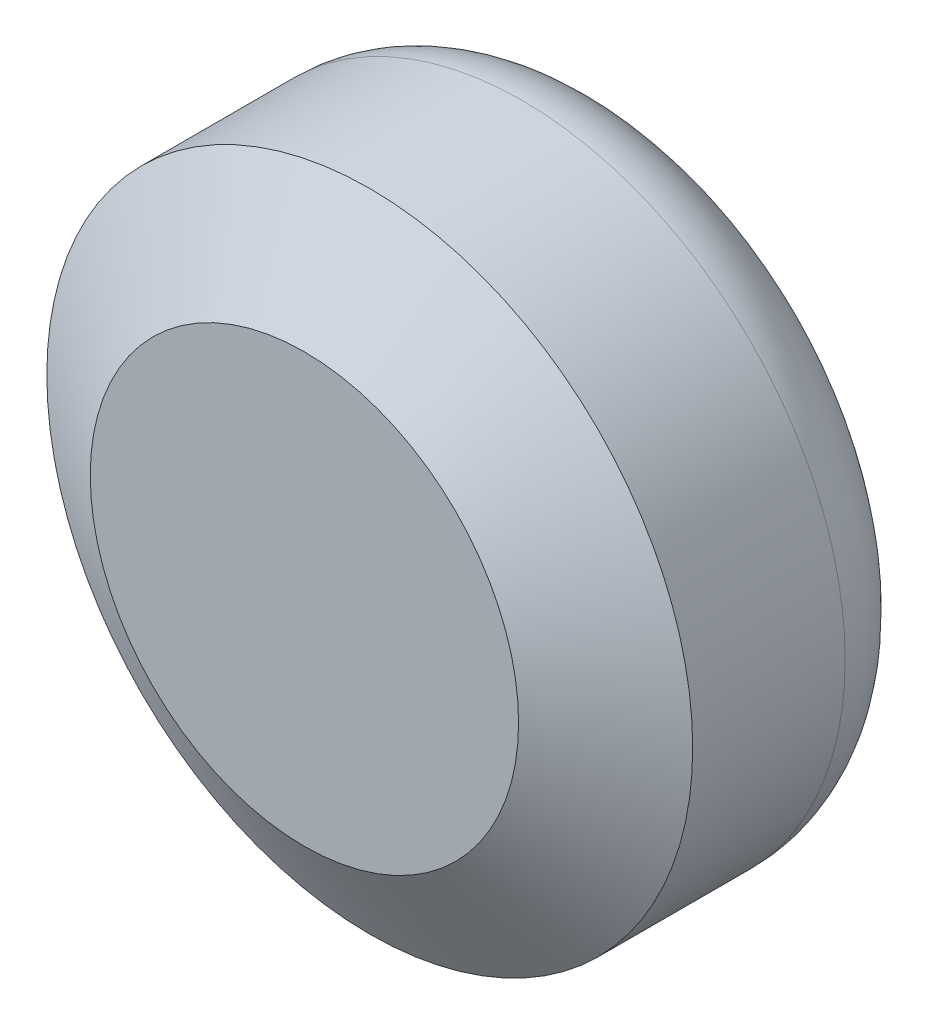
ISO-10303-21;
HEADER;
FILE_DESCRIPTION(('STEP AP214'),'2;1');
FILE_NAME('part.step','',(''),(''),'','','');
FILE_SCHEMA(('AUTOMOTIVE_DESIGN { 1 0 10303 214 1 1 1 1 }'));
ENDSEC;
DATA;
#1=APPLICATION_CONTEXT('core data for automotive mechanical design processes');
#2=APPLICATION_PROTOCOL_DEFINITION('international standard','automotive_design',2000,#1);
#3=PRODUCT_CONTEXT('',#1,'mechanical');
#4=PRODUCT('Part','Part','',(#3));
#5=PRODUCT_RELATED_PRODUCT_CATEGORY('part','',(#4));
#6=PRODUCT_DEFINITION_FORMATION('','',#4);
#7=PRODUCT_DEFINITION_CONTEXT('part definition',#1,'design');
#8=PRODUCT_DEFINITION('design','',#6,#7);
#9=PRODUCT_DEFINITION_SHAPE('','',#8);
#10=(LENGTH_UNIT() NAMED_UNIT(*) SI_UNIT(.MILLI.,.METRE.));
#11=(NAMED_UNIT(*) PLANE_ANGLE_UNIT() SI_UNIT($,.RADIAN.));
#12=(NAMED_UNIT(*) SI_UNIT($,.STERADIAN.) SOLID_ANGLE_UNIT());
#13=UNCERTAINTY_MEASURE_WITH_UNIT(LENGTH_MEASURE(1.E-05),#10,'distance_accuracy_value','');
#14=(GEOMETRIC_REPRESENTATION_CONTEXT(3) GLOBAL_UNCERTAINTY_ASSIGNED_CONTEXT((#13)) GLOBAL_UNIT_ASSIGNED_CONTEXT((#10,
#11,#12)) REPRESENTATION_CONTEXT('',''));
#15=CARTESIAN_POINT('',(0.,0.,0.));
#16=DIRECTION('',(0.,0.,1.));
#17=DIRECTION('',(1.,0.,0.));
#18=AXIS2_PLACEMENT_3D('',#15,#16,#17);
#19=CARTESIAN_POINT('',(-35.5777305835289,22.6224810051335,28.));
#20=DIRECTION('',(0.,0.,-1.));
#21=DIRECTION('',(-1.,0.,0.));
#22=AXIS2_PLACEMENT_3D('',#19,#20,#21);
#23=CYLINDRICAL_SURFACE('',#22,29.65);
#24=CARTESIAN_POINT('',(-35.5777305835289,22.6224810051335,8.));
#25=DIRECTION('',(0.,0.,1.));
#26=DIRECTION('',(1.,0.,0.));
#27=AXIS2_PLACEMENT_3D('',#24,#25,#26);
#28=CIRCLE('',#27,29.65);
#29=CARTESIAN_POINT('',(-5.92773058352891,22.6224810051335,8.));
#30=VERTEX_POINT('',#29);
#31=EDGE_CURVE('E38',#30,#30,#28,.T.);
#32=ORIENTED_EDGE('',*,*,#31,.T.);
#33=EDGE_LOOP('',(#32));
#34=FACE_BOUND('',#33,.T.);
#35=CARTESIAN_POINT('',(-35.5777305835289,22.6224810051335,22.));
#36=DIRECTION('',(0.,0.,1.));
#37=DIRECTION('',(1.,0.,0.));
#38=AXIS2_PLACEMENT_3D('',#35,#36,#37);
#39=CIRCLE('',#38,29.65);
#40=CARTESIAN_POINT('',(-5.92773058352891,22.6224810051335,22.));
#41=VERTEX_POINT('',#40);
#42=EDGE_CURVE('E42',#41,#41,#39,.F.);
#43=ORIENTED_EDGE('',*,*,#42,.T.);
#44=EDGE_LOOP('',(#43));
#45=FACE_BOUND('',#44,.T.);
#46=ADVANCED_FACE('F31',(#34,#45),#23,.T.);
#47=CARTESIAN_POINT('',(-35.5777305835289,22.6224810051335,28.));
#48=DIRECTION('',(0.,0.,1.));
#49=DIRECTION('',(1.,0.,0.));
#50=AXIS2_PLACEMENT_3D('',#47,#48,#49);
#51=PLANE('',#50);
#52=CARTESIAN_POINT('',(-35.5777305835289,22.6224810051335,28.));
#53=DIRECTION('',(0.,0.,1.));
#54=DIRECTION('',(1.,0.,0.));
#55=AXIS2_PLACEMENT_3D('',#52,#53,#54);
#56=CIRCLE('',#55,19.664323105897);
#57=CARTESIAN_POINT('',(-15.913407477632,22.6224810051335,28.));
#58=VERTEX_POINT('',#57);
#59=EDGE_CURVE('E46',#58,#58,#56,.T.);
#60=ORIENTED_EDGE('',*,*,#59,.T.);
#61=EDGE_LOOP('',(#60));
#62=FACE_BOUND('',#61,.T.);
#63=ADVANCED_FACE('F52',(#62),#51,.T.);
#64=CARTESIAN_POINT('',(-35.5777305835289,22.6224810051335,0.));
#65=DIRECTION('',(0.,0.,1.));
#66=DIRECTION('',(1.,0.,0.));
#67=AXIS2_PLACEMENT_3D('',#64,#65,#66);
#68=PLANE('',#67);
#69=CARTESIAN_POINT('',(-35.5777305835289,22.6224810051335,0.));
#70=DIRECTION('',(0.,0.,1.));
#71=DIRECTION('',(1.,0.,0.));
#72=AXIS2_PLACEMENT_3D('',#69,#70,#71);
#73=CIRCLE('',#72,21.65);
#74=CARTESIAN_POINT('',(-13.9277305835289,22.6224810051335,0.));
#75=VERTEX_POINT('',#74);
#76=EDGE_CURVE('E10',#75,#75,#73,.F.);
#77=ORIENTED_EDGE('',*,*,#76,.T.);
#78=EDGE_LOOP('',(#77));
#79=FACE_BOUND('',#78,.T.);
#80=ADVANCED_FACE('F56',(#79),#68,.F.);
#81=CARTESIAN_POINT('',(-35.5777305835289,22.6224810051335,28.));
#82=DIRECTION('',(0.,0.,-1.));
#83=DIRECTION('',(-1.,0.,0.));
#84=AXIS2_PLACEMENT_3D('',#81,#82,#83);
#85=CONICAL_SURFACE('',#84,19.664323105897,1.02974425867665);
#86=ORIENTED_EDGE('',*,*,#42,.F.);
#87=EDGE_LOOP('',(#86));
#88=FACE_BOUND('',#87,.T.);
#89=ORIENTED_EDGE('',*,*,#59,.F.);
#90=EDGE_LOOP('',(#89));
#91=FACE_BOUND('',#90,.T.);
#92=ADVANCED_FACE('F54',(#88,#91),#85,.T.);
#93=CARTESIAN_POINT('',(-35.5777305835289,22.6224810051335,8.));
#94=DIRECTION('',(0.,0.,1.));
#95=DIRECTION('',(1.,0.,0.));
#96=AXIS2_PLACEMENT_3D('',#93,#94,#95);
#97=TOROIDAL_SURFACE('',#96,21.65,8.);
#98=ORIENTED_EDGE('',*,*,#76,.F.);
#99=EDGE_LOOP('',(#98));
#100=FACE_BOUND('',#99,.T.);
#101=ORIENTED_EDGE('',*,*,#31,.F.);
#102=EDGE_LOOP('',(#101));
#103=FACE_BOUND('',#102,.T.);
#104=ADVANCED_FACE('F33',(#100,#103),#97,.T.);
#105=CLOSED_SHELL('',(#46,#63,#80,#92,#104));
#106=MANIFOLD_SOLID_BREP('B2',#105);
#107=ADVANCED_BREP_SHAPE_REPRESENTATION('',(#18,#106),#14);
#108=SHAPE_DEFINITION_REPRESENTATION(#9,#107);
ENDSEC;
END-ISO-10303-21;
